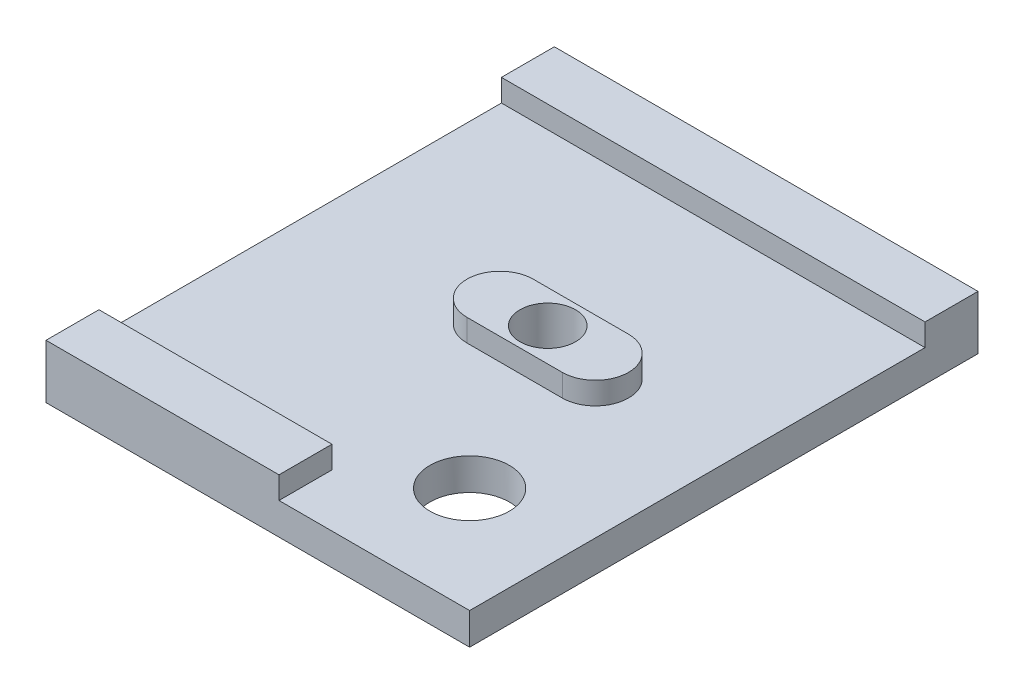
ISO-10303-21;
HEADER;
FILE_DESCRIPTION(('STEP AP214'),'2;1');
FILE_NAME('part.step','',(''),(''),'','','');
FILE_SCHEMA(('AUTOMOTIVE_DESIGN { 1 0 10303 214 1 1 1 1 }'));
ENDSEC;
DATA;
#1=APPLICATION_CONTEXT('core data for automotive mechanical design processes');
#2=APPLICATION_PROTOCOL_DEFINITION('international standard','automotive_design',2000,#1);
#3=PRODUCT_CONTEXT('',#1,'mechanical');
#4=PRODUCT('Part','Part','',(#3));
#5=PRODUCT_RELATED_PRODUCT_CATEGORY('part','',(#4));
#6=PRODUCT_DEFINITION_FORMATION('','',#4);
#7=PRODUCT_DEFINITION_CONTEXT('part definition',#1,'design');
#8=PRODUCT_DEFINITION('design','',#6,#7);
#9=PRODUCT_DEFINITION_SHAPE('','',#8);
#10=(LENGTH_UNIT() NAMED_UNIT(*) SI_UNIT(.MILLI.,.METRE.));
#11=(NAMED_UNIT(*) PLANE_ANGLE_UNIT() SI_UNIT($,.RADIAN.));
#12=(NAMED_UNIT(*) SI_UNIT($,.STERADIAN.) SOLID_ANGLE_UNIT());
#13=UNCERTAINTY_MEASURE_WITH_UNIT(LENGTH_MEASURE(1.E-05),#10,'distance_accuracy_value','');
#14=(GEOMETRIC_REPRESENTATION_CONTEXT(3) GLOBAL_UNCERTAINTY_ASSIGNED_CONTEXT((#13)) GLOBAL_UNIT_ASSIGNED_CONTEXT((#10,
#11,#12)) REPRESENTATION_CONTEXT('',''));
#15=CARTESIAN_POINT('',(0.,0.,0.));
#16=DIRECTION('',(0.,0.,1.));
#17=DIRECTION('',(1.,0.,0.));
#18=AXIS2_PLACEMENT_3D('',#15,#16,#17);
#19=CARTESIAN_POINT('',(0.,3.,0.));
#20=DIRECTION('',(0.,-1.,0.));
#21=DIRECTION('',(0.,0.,-1.));
#22=AXIS2_PLACEMENT_3D('',#19,#20,#21);
#23=PLANE('',#22);
#24=CARTESIAN_POINT('',(10.,3.,14.));
#25=DIRECTION('',(0.,-1.,0.));
#26=DIRECTION('',(0.,0.,-1.));
#27=AXIS2_PLACEMENT_3D('',#24,#25,#26);
#28=CIRCLE('',#27,3.75);
#29=CARTESIAN_POINT('',(10.,3.,10.25));
#30=VERTEX_POINT('',#29);
#31=EDGE_CURVE('E257',#30,#30,#28,.T.);
#32=ORIENTED_EDGE('',*,*,#31,.T.);
#33=EDGE_LOOP('',(#32));
#34=FACE_BOUND('',#33,.T.);
#35=CARTESIAN_POINT('',(-2.,3.,-0.874999999999996));
#36=DIRECTION('',(0.,1.,0.));
#37=DIRECTION('',(0.,0.,1.));
#38=AXIS2_PLACEMENT_3D('',#35,#36,#37);
#39=CIRCLE('',#38,3.125);
#40=CARTESIAN_POINT('',(-2.,3.,-4.));
#41=VERTEX_POINT('',#40);
#42=CARTESIAN_POINT('',(-2.,3.,2.25));
#43=VERTEX_POINT('',#42);
#44=EDGE_CURVE('E64',#41,#43,#39,.T.);
#45=ORIENTED_EDGE('',*,*,#44,.F.);
#46=DIRECTION('',(1.,0.,0.));
#47=VECTOR('',#46,1.);
#48=CARTESIAN_POINT('',(0.,3.,-4.));
#49=LINE('',#48,#47);
#50=CARTESIAN_POINT('',(7.,3.,-4.));
#51=VERTEX_POINT('',#50);
#52=EDGE_CURVE('E162',#41,#51,#49,.T.);
#53=ORIENTED_EDGE('',*,*,#52,.T.);
#54=CARTESIAN_POINT('',(7.,3.,-0.874999999999996));
#55=DIRECTION('',(0.,1.,0.));
#56=DIRECTION('',(0.,0.,1.));
#57=AXIS2_PLACEMENT_3D('',#54,#55,#56);
#58=CIRCLE('',#57,3.125);
#59=CARTESIAN_POINT('',(7.,3.,2.25));
#60=VERTEX_POINT('',#59);
#61=EDGE_CURVE('E172',#60,#51,#58,.T.);
#62=ORIENTED_EDGE('',*,*,#61,.F.);
#63=DIRECTION('',(1.,0.,0.));
#64=VECTOR('',#63,1.);
#65=CARTESIAN_POINT('',(0.,3.,2.25));
#66=LINE('',#65,#64);
#67=EDGE_CURVE('E180',#43,#60,#66,.T.);
#68=ORIENTED_EDGE('',*,*,#67,.F.);
#69=EDGE_LOOP('',(#45,#53,#62,#68));
#70=FACE_BOUND('',#69,.T.);
#71=DIRECTION('',(1.,0.,0.));
#72=VECTOR('',#71,1.);
#73=CARTESIAN_POINT('',(0.,3.,-19.));
#74=LINE('',#73,#72);
#75=CARTESIAN_POINT('',(-20.,3.,-19.));
#76=VERTEX_POINT('',#75);
#77=CARTESIAN_POINT('',(20.,3.,-19.));
#78=VERTEX_POINT('',#77);
#79=EDGE_CURVE('E157',#76,#78,#74,.T.);
#80=ORIENTED_EDGE('',*,*,#79,.F.);
#81=DIRECTION('',(0.,0.,1.));
#82=VECTOR('',#81,1.);
#83=CARTESIAN_POINT('',(-20.,3.,24.));
#84=LINE('',#83,#82);
#85=CARTESIAN_POINT('',(-20.,3.,19.));
#86=VERTEX_POINT('',#85);
#87=EDGE_CURVE('E161',#76,#86,#84,.T.);
#88=ORIENTED_EDGE('',*,*,#87,.T.);
#89=DIRECTION('',(1.,0.,0.));
#90=VECTOR('',#89,1.);
#91=CARTESIAN_POINT('',(0.,3.,19.));
#92=LINE('',#91,#90);
#93=CARTESIAN_POINT('',(2.,3.,19.));
#94=VERTEX_POINT('',#93);
#95=EDGE_CURVE('E200',#86,#94,#92,.T.);
#96=ORIENTED_EDGE('',*,*,#95,.T.);
#97=DIRECTION('',(0.,0.,1.));
#98=VECTOR('',#97,1.);
#99=CARTESIAN_POINT('',(2.,3.,0.));
#100=LINE('',#99,#98);
#101=CARTESIAN_POINT('',(2.,3.,24.));
#102=VERTEX_POINT('',#101);
#103=EDGE_CURVE('E195',#94,#102,#100,.T.);
#104=ORIENTED_EDGE('',*,*,#103,.T.);
#105=DIRECTION('',(1.,0.,0.));
#106=VECTOR('',#105,1.);
#107=CARTESIAN_POINT('',(-20.,3.,24.));
#108=LINE('',#107,#106);
#109=CARTESIAN_POINT('',(20.,3.,24.));
#110=VERTEX_POINT('',#109);
#111=EDGE_CURVE('E223',#102,#110,#108,.T.);
#112=ORIENTED_EDGE('',*,*,#111,.T.);
#113=DIRECTION('',(0.,0.,-1.));
#114=VECTOR('',#113,1.);
#115=CARTESIAN_POINT('',(20.,3.,24.));
#116=LINE('',#115,#114);
#117=EDGE_CURVE('E56',#110,#78,#116,.T.);
#118=ORIENTED_EDGE('',*,*,#117,.T.);
#119=EDGE_LOOP('',(#80,#88,#96,#104,#112,#118));
#120=FACE_BOUND('',#119,.T.);
#121=ADVANCED_FACE('F40',(#34,#70,#120),#23,.F.);
#122=CARTESIAN_POINT('',(20.,3.,24.));
#123=DIRECTION('',(-1.,0.,0.));
#124=DIRECTION('',(0.,0.,1.));
#125=AXIS2_PLACEMENT_3D('',#122,#123,#124);
#126=PLANE('',#125);
#127=DIRECTION('',(0.,0.,-1.));
#128=VECTOR('',#127,1.);
#129=CARTESIAN_POINT('',(20.,0.,24.));
#130=LINE('',#129,#128);
#131=CARTESIAN_POINT('',(20.,0.,24.));
#132=VERTEX_POINT('',#131);
#133=CARTESIAN_POINT('',(20.,0.,-24.));
#134=VERTEX_POINT('',#133);
#135=EDGE_CURVE('E219',#132,#134,#130,.T.);
#136=ORIENTED_EDGE('',*,*,#135,.T.);
#137=DIRECTION('',(0.,-1.,0.));
#138=VECTOR('',#137,1.);
#139=CARTESIAN_POINT('',(20.,3.,-24.));
#140=LINE('',#139,#138);
#141=CARTESIAN_POINT('',(20.,5.1,-24.));
#142=VERTEX_POINT('',#141);
#143=EDGE_CURVE('E11',#142,#134,#140,.T.);
#144=ORIENTED_EDGE('',*,*,#143,.F.);
#145=DIRECTION('',(0.,0.,-1.));
#146=VECTOR('',#145,1.);
#147=CARTESIAN_POINT('',(20.,5.1,0.));
#148=LINE('',#147,#146);
#149=CARTESIAN_POINT('',(20.,5.1,-19.));
#150=VERTEX_POINT('',#149);
#151=EDGE_CURVE('E147',#150,#142,#148,.T.);
#152=ORIENTED_EDGE('',*,*,#151,.F.);
#153=DIRECTION('',(0.,-1.,0.));
#154=VECTOR('',#153,1.);
#155=CARTESIAN_POINT('',(20.,5.1,-19.));
#156=LINE('',#155,#154);
#157=EDGE_CURVE('E143',#150,#78,#156,.T.);
#158=ORIENTED_EDGE('',*,*,#157,.T.);
#159=ORIENTED_EDGE('',*,*,#117,.F.);
#160=DIRECTION('',(0.,-1.,0.));
#161=VECTOR('',#160,1.);
#162=CARTESIAN_POINT('',(20.,3.,24.));
#163=LINE('',#162,#161);
#164=EDGE_CURVE('E225',#110,#132,#163,.T.);
#165=ORIENTED_EDGE('',*,*,#164,.T.);
#166=EDGE_LOOP('',(#136,#144,#152,#158,#159,#165));
#167=FACE_BOUND('',#166,.T.);
#168=ADVANCED_FACE('F42',(#167),#126,.F.);
#169=CARTESIAN_POINT('',(-20.,3.,-24.));
#170=DIRECTION('',(0.,0.,1.));
#171=DIRECTION('',(1.,0.,0.));
#172=AXIS2_PLACEMENT_3D('',#169,#170,#171);
#173=PLANE('',#172);
#174=DIRECTION('',(-1.,0.,0.));
#175=VECTOR('',#174,1.);
#176=CARTESIAN_POINT('',(-20.,0.,-24.));
#177=LINE('',#176,#175);
#178=CARTESIAN_POINT('',(-20.,0.,-24.));
#179=VERTEX_POINT('',#178);
#180=EDGE_CURVE('E228',#134,#179,#177,.T.);
#181=ORIENTED_EDGE('',*,*,#180,.T.);
#182=DIRECTION('',(0.,-1.,0.));
#183=VECTOR('',#182,1.);
#184=CARTESIAN_POINT('',(-20.,3.,-24.));
#185=LINE('',#184,#183);
#186=CARTESIAN_POINT('',(-20.,5.1,-24.));
#187=VERTEX_POINT('',#186);
#188=EDGE_CURVE('E49',#187,#179,#185,.T.);
#189=ORIENTED_EDGE('',*,*,#188,.F.);
#190=DIRECTION('',(-1.,0.,0.));
#191=VECTOR('',#190,1.);
#192=CARTESIAN_POINT('',(0.,5.1,-24.));
#193=LINE('',#192,#191);
#194=EDGE_CURVE('E154',#142,#187,#193,.T.);
#195=ORIENTED_EDGE('',*,*,#194,.F.);
#196=ORIENTED_EDGE('',*,*,#143,.T.);
#197=EDGE_LOOP('',(#181,#189,#195,#196));
#198=FACE_BOUND('',#197,.T.);
#199=ADVANCED_FACE('F309',(#198),#173,.F.);
#200=CARTESIAN_POINT('',(-20.,3.,24.));
#201=DIRECTION('',(1.,0.,0.));
#202=DIRECTION('',(0.,0.,-1.));
#203=AXIS2_PLACEMENT_3D('',#200,#201,#202);
#204=PLANE('',#203);
#205=DIRECTION('',(0.,0.,1.));
#206=VECTOR('',#205,1.);
#207=CARTESIAN_POINT('',(-20.,0.,24.));
#208=LINE('',#207,#206);
#209=CARTESIAN_POINT('',(-20.,0.,24.));
#210=VERTEX_POINT('',#209);
#211=EDGE_CURVE('E230',#179,#210,#208,.T.);
#212=ORIENTED_EDGE('',*,*,#211,.T.);
#213=DIRECTION('',(0.,-1.,0.));
#214=VECTOR('',#213,1.);
#215=CARTESIAN_POINT('',(-20.,3.,24.));
#216=LINE('',#215,#214);
#217=CARTESIAN_POINT('',(-20.,5.1,24.));
#218=VERTEX_POINT('',#217);
#219=EDGE_CURVE('E235',#218,#210,#216,.T.);
#220=ORIENTED_EDGE('',*,*,#219,.F.);
#221=DIRECTION('',(0.,0.,1.));
#222=VECTOR('',#221,1.);
#223=CARTESIAN_POINT('',(-20.,5.1,0.));
#224=LINE('',#223,#222);
#225=CARTESIAN_POINT('',(-20.,5.1,19.));
#226=VERTEX_POINT('',#225);
#227=EDGE_CURVE('E203',#226,#218,#224,.T.);
#228=ORIENTED_EDGE('',*,*,#227,.F.);
#229=DIRECTION('',(0.,-1.,0.));
#230=VECTOR('',#229,1.);
#231=CARTESIAN_POINT('',(-20.,5.1,19.));
#232=LINE('',#231,#230);
#233=EDGE_CURVE('E214',#226,#86,#232,.T.);
#234=ORIENTED_EDGE('',*,*,#233,.T.);
#235=ORIENTED_EDGE('',*,*,#87,.F.);
#236=DIRECTION('',(0.,-1.,0.));
#237=VECTOR('',#236,1.);
#238=CARTESIAN_POINT('',(-20.,5.1,-19.));
#239=LINE('',#238,#237);
#240=CARTESIAN_POINT('',(-20.,5.1,-19.));
#241=VERTEX_POINT('',#240);
#242=EDGE_CURVE('E141',#241,#76,#239,.T.);
#243=ORIENTED_EDGE('',*,*,#242,.F.);
#244=DIRECTION('',(0.,0.,1.));
#245=VECTOR('',#244,1.);
#246=CARTESIAN_POINT('',(-20.,5.1,0.));
#247=LINE('',#246,#245);
#248=EDGE_CURVE('E148',#187,#241,#247,.T.);
#249=ORIENTED_EDGE('',*,*,#248,.F.);
#250=ORIENTED_EDGE('',*,*,#188,.T.);
#251=EDGE_LOOP('',(#212,#220,#228,#234,#235,#243,#249,#250));
#252=FACE_BOUND('',#251,.T.);
#253=ADVANCED_FACE('F159',(#252),#204,.F.);
#254=CARTESIAN_POINT('',(-20.,3.,24.));
#255=DIRECTION('',(0.,0.,-1.));
#256=DIRECTION('',(-1.,0.,0.));
#257=AXIS2_PLACEMENT_3D('',#254,#255,#256);
#258=PLANE('',#257);
#259=DIRECTION('',(1.,0.,0.));
#260=VECTOR('',#259,1.);
#261=CARTESIAN_POINT('',(-20.,0.,24.));
#262=LINE('',#261,#260);
#263=EDGE_CURVE('E221',#210,#132,#262,.T.);
#264=ORIENTED_EDGE('',*,*,#263,.T.);
#265=ORIENTED_EDGE('',*,*,#164,.F.);
#266=ORIENTED_EDGE('',*,*,#111,.F.);
#267=DIRECTION('',(0.,-1.,0.));
#268=VECTOR('',#267,1.);
#269=CARTESIAN_POINT('',(2.,5.1,24.));
#270=LINE('',#269,#268);
#271=CARTESIAN_POINT('',(2.,5.1,24.));
#272=VERTEX_POINT('',#271);
#273=EDGE_CURVE('E208',#272,#102,#270,.T.);
#274=ORIENTED_EDGE('',*,*,#273,.F.);
#275=DIRECTION('',(1.,0.,0.));
#276=VECTOR('',#275,1.);
#277=CARTESIAN_POINT('',(0.,5.1,24.));
#278=LINE('',#277,#276);
#279=EDGE_CURVE('E206',#218,#272,#278,.T.);
#280=ORIENTED_EDGE('',*,*,#279,.F.);
#281=ORIENTED_EDGE('',*,*,#219,.T.);
#282=EDGE_LOOP('',(#264,#265,#266,#274,#280,#281));
#283=FACE_BOUND('',#282,.T.);
#284=ADVANCED_FACE('F246',(#283),#258,.F.);
#285=CARTESIAN_POINT('',(0.,0.,0.));
#286=DIRECTION('',(0.,-1.,0.));
#287=DIRECTION('',(0.,0.,-1.));
#288=AXIS2_PLACEMENT_3D('',#285,#286,#287);
#289=PLANE('',#288);
#290=CARTESIAN_POINT('',(10.,0.,14.));
#291=DIRECTION('',(0.,1.,0.));
#292=DIRECTION('',(0.,0.,1.));
#293=AXIS2_PLACEMENT_3D('',#290,#291,#292);
#294=CIRCLE('',#293,3.75);
#295=CARTESIAN_POINT('',(10.,0.,17.75));
#296=VERTEX_POINT('',#295);
#297=EDGE_CURVE('E262',#296,#296,#294,.T.);
#298=ORIENTED_EDGE('',*,*,#297,.T.);
#299=EDGE_LOOP('',(#298));
#300=FACE_BOUND('',#299,.T.);
#301=CARTESIAN_POINT('',(2.49999999999887,0.,-0.875000000003864));
#302=DIRECTION('',(0.,1.,0.));
#303=DIRECTION('',(0.,0.,1.));
#304=AXIS2_PLACEMENT_3D('',#301,#302,#303);
#305=CIRCLE('',#304,2.625);
#306=CARTESIAN_POINT('',(2.49999999999887,0.,1.74999999999614));
#307=VERTEX_POINT('',#306);
#308=EDGE_CURVE('E253',#307,#307,#305,.T.);
#309=ORIENTED_EDGE('',*,*,#308,.T.);
#310=EDGE_LOOP('',(#309));
#311=FACE_BOUND('',#310,.T.);
#312=ORIENTED_EDGE('',*,*,#135,.F.);
#313=ORIENTED_EDGE('',*,*,#263,.F.);
#314=ORIENTED_EDGE('',*,*,#211,.F.);
#315=ORIENTED_EDGE('',*,*,#180,.F.);
#316=EDGE_LOOP('',(#312,#313,#314,#315));
#317=FACE_BOUND('',#316,.T.);
#318=ADVANCED_FACE('F243',(#300,#311,#317),#289,.T.);
#319=CARTESIAN_POINT('',(2.,5.1,0.));
#320=DIRECTION('',(1.,0.,0.));
#321=DIRECTION('',(0.,0.,-1.));
#322=AXIS2_PLACEMENT_3D('',#319,#320,#321);
#323=PLANE('',#322);
#324=ORIENTED_EDGE('',*,*,#103,.F.);
#325=DIRECTION('',(0.,-1.,0.));
#326=VECTOR('',#325,1.);
#327=CARTESIAN_POINT('',(2.,5.1,19.));
#328=LINE('',#327,#326);
#329=CARTESIAN_POINT('',(2.,5.1,19.));
#330=VERTEX_POINT('',#329);
#331=EDGE_CURVE('E216',#330,#94,#328,.T.);
#332=ORIENTED_EDGE('',*,*,#331,.F.);
#333=DIRECTION('',(0.,0.,1.));
#334=VECTOR('',#333,1.);
#335=CARTESIAN_POINT('',(2.,5.1,0.));
#336=LINE('',#335,#334);
#337=EDGE_CURVE('E196',#330,#272,#336,.T.);
#338=ORIENTED_EDGE('',*,*,#337,.T.);
#339=ORIENTED_EDGE('',*,*,#273,.T.);
#340=EDGE_LOOP('',(#324,#332,#338,#339));
#341=FACE_BOUND('',#340,.T.);
#342=ADVANCED_FACE('F285',(#341),#323,.T.);
#343=CARTESIAN_POINT('',(0.,5.1,19.));
#344=DIRECTION('',(0.,0.,-1.));
#345=DIRECTION('',(-1.,0.,0.));
#346=AXIS2_PLACEMENT_3D('',#343,#344,#345);
#347=PLANE('',#346);
#348=ORIENTED_EDGE('',*,*,#95,.F.);
#349=ORIENTED_EDGE('',*,*,#233,.F.);
#350=DIRECTION('',(1.,0.,0.));
#351=VECTOR('',#350,1.);
#352=CARTESIAN_POINT('',(0.,5.1,19.));
#353=LINE('',#352,#351);
#354=EDGE_CURVE('E199',#226,#330,#353,.T.);
#355=ORIENTED_EDGE('',*,*,#354,.T.);
#356=ORIENTED_EDGE('',*,*,#331,.T.);
#357=EDGE_LOOP('',(#348,#349,#355,#356));
#358=FACE_BOUND('',#357,.T.);
#359=ADVANCED_FACE('F282',(#358),#347,.T.);
#360=CARTESIAN_POINT('',(0.,5.1,0.));
#361=DIRECTION('',(0.,1.,0.));
#362=DIRECTION('',(0.,0.,1.));
#363=AXIS2_PLACEMENT_3D('',#360,#361,#362);
#364=PLANE('',#363);
#365=ORIENTED_EDGE('',*,*,#337,.F.);
#366=ORIENTED_EDGE('',*,*,#354,.F.);
#367=ORIENTED_EDGE('',*,*,#227,.T.);
#368=ORIENTED_EDGE('',*,*,#279,.T.);
#369=EDGE_LOOP('',(#365,#366,#367,#368));
#370=FACE_BOUND('',#369,.T.);
#371=ADVANCED_FACE('F287',(#370),#364,.T.);
#372=CARTESIAN_POINT('',(0.,5.1,-4.));
#373=DIRECTION('',(0.,0.,-1.));
#374=DIRECTION('',(-1.,0.,0.));
#375=AXIS2_PLACEMENT_3D('',#372,#373,#374);
#376=PLANE('',#375);
#377=ORIENTED_EDGE('',*,*,#52,.F.);
#378=DIRECTION('',(0.,-1.,0.));
#379=VECTOR('',#378,1.);
#380=CARTESIAN_POINT('',(-2.,5.1,-4.));
#381=LINE('',#380,#379);
#382=CARTESIAN_POINT('',(-2.,5.1,-4.));
#383=VERTEX_POINT('',#382);
#384=EDGE_CURVE('E193',#383,#41,#381,.T.);
#385=ORIENTED_EDGE('',*,*,#384,.F.);
#386=DIRECTION('',(1.,0.,0.));
#387=VECTOR('',#386,1.);
#388=CARTESIAN_POINT('',(0.,5.1,-4.));
#389=LINE('',#388,#387);
#390=CARTESIAN_POINT('',(7.,5.1,-4.));
#391=VERTEX_POINT('',#390);
#392=EDGE_CURVE('E168',#383,#391,#389,.T.);
#393=ORIENTED_EDGE('',*,*,#392,.T.);
#394=DIRECTION('',(0.,-1.,0.));
#395=VECTOR('',#394,1.);
#396=CARTESIAN_POINT('',(7.,5.1,-4.));
#397=LINE('',#396,#395);
#398=EDGE_CURVE('E177',#391,#51,#397,.T.);
#399=ORIENTED_EDGE('',*,*,#398,.T.);
#400=EDGE_LOOP('',(#377,#385,#393,#399));
#401=FACE_BOUND('',#400,.T.);
#402=ADVANCED_FACE('F290',(#401),#376,.T.);
#403=CARTESIAN_POINT('',(-2.,5.1,-0.874999999999996));
#404=DIRECTION('',(0.,-1.,0.));
#405=DIRECTION('',(0.,0.,-1.));
#406=AXIS2_PLACEMENT_3D('',#403,#404,#405);
#407=CYLINDRICAL_SURFACE('',#406,3.125);
#408=ORIENTED_EDGE('',*,*,#44,.T.);
#409=DIRECTION('',(0.,-1.,0.));
#410=VECTOR('',#409,1.);
#411=CARTESIAN_POINT('',(-2.,5.1,2.25));
#412=LINE('',#411,#410);
#413=CARTESIAN_POINT('',(-2.,5.1,2.25));
#414=VERTEX_POINT('',#413);
#415=EDGE_CURVE('E190',#414,#43,#412,.T.);
#416=ORIENTED_EDGE('',*,*,#415,.F.);
#417=CARTESIAN_POINT('',(-2.,5.1,-0.874999999999996));
#418=DIRECTION('',(0.,1.,0.));
#419=DIRECTION('',(0.,0.,1.));
#420=AXIS2_PLACEMENT_3D('',#417,#418,#419);
#421=CIRCLE('',#420,3.125);
#422=EDGE_CURVE('E171',#383,#414,#421,.T.);
#423=ORIENTED_EDGE('',*,*,#422,.F.);
#424=ORIENTED_EDGE('',*,*,#384,.T.);
#425=EDGE_LOOP('',(#408,#416,#423,#424));
#426=FACE_BOUND('',#425,.T.);
#427=ADVANCED_FACE('F296',(#426),#407,.T.);
#428=CARTESIAN_POINT('',(0.,5.1,2.25));
#429=DIRECTION('',(0.,0.,-1.));
#430=DIRECTION('',(-1.,0.,0.));
#431=AXIS2_PLACEMENT_3D('',#428,#429,#430);
#432=PLANE('',#431);
#433=ORIENTED_EDGE('',*,*,#67,.T.);
#434=DIRECTION('',(0.,-1.,0.));
#435=VECTOR('',#434,1.);
#436=CARTESIAN_POINT('',(7.,5.1,2.25));
#437=LINE('',#436,#435);
#438=CARTESIAN_POINT('',(7.,5.1,2.25));
#439=VERTEX_POINT('',#438);
#440=EDGE_CURVE('E187',#439,#60,#437,.T.);
#441=ORIENTED_EDGE('',*,*,#440,.F.);
#442=DIRECTION('',(1.,0.,0.));
#443=VECTOR('',#442,1.);
#444=CARTESIAN_POINT('',(0.,5.1,2.25));
#445=LINE('',#444,#443);
#446=EDGE_CURVE('E174',#414,#439,#445,.T.);
#447=ORIENTED_EDGE('',*,*,#446,.F.);
#448=ORIENTED_EDGE('',*,*,#415,.T.);
#449=EDGE_LOOP('',(#433,#441,#447,#448));
#450=FACE_BOUND('',#449,.T.);
#451=ADVANCED_FACE('F366',(#450),#432,.F.);
#452=CARTESIAN_POINT('',(7.,5.1,-0.874999999999996));
#453=DIRECTION('',(0.,-1.,0.));
#454=DIRECTION('',(0.,0.,-1.));
#455=AXIS2_PLACEMENT_3D('',#452,#453,#454);
#456=CYLINDRICAL_SURFACE('',#455,3.125);
#457=ORIENTED_EDGE('',*,*,#61,.T.);
#458=ORIENTED_EDGE('',*,*,#398,.F.);
#459=CARTESIAN_POINT('',(7.,5.1,-0.874999999999996));
#460=DIRECTION('',(0.,1.,0.));
#461=DIRECTION('',(0.,0.,1.));
#462=AXIS2_PLACEMENT_3D('',#459,#460,#461);
#463=CIRCLE('',#462,3.125);
#464=EDGE_CURVE('E176',#439,#391,#463,.T.);
#465=ORIENTED_EDGE('',*,*,#464,.F.);
#466=ORIENTED_EDGE('',*,*,#440,.T.);
#467=EDGE_LOOP('',(#457,#458,#465,#466));
#468=FACE_BOUND('',#467,.T.);
#469=ADVANCED_FACE('F359',(#468),#456,.T.);
#470=CARTESIAN_POINT('',(0.,5.1,0.));
#471=DIRECTION('',(0.,1.,0.));
#472=DIRECTION('',(0.,0.,1.));
#473=AXIS2_PLACEMENT_3D('',#470,#471,#472);
#474=PLANE('',#473);
#475=CARTESIAN_POINT('',(2.49999999999887,5.1,-0.875000000003864));
#476=DIRECTION('',(0.,1.,0.));
#477=DIRECTION('',(0.,0.,1.));
#478=AXIS2_PLACEMENT_3D('',#475,#476,#477);
#479=CIRCLE('',#478,2.625);
#480=CARTESIAN_POINT('',(2.49999999999887,5.1,1.74999999999614));
#481=VERTEX_POINT('',#480);
#482=EDGE_CURVE('E44',#481,#481,#479,.T.);
#483=ORIENTED_EDGE('',*,*,#482,.F.);
#484=EDGE_LOOP('',(#483));
#485=FACE_BOUND('',#484,.T.);
#486=ORIENTED_EDGE('',*,*,#392,.F.);
#487=ORIENTED_EDGE('',*,*,#422,.T.);
#488=ORIENTED_EDGE('',*,*,#446,.T.);
#489=ORIENTED_EDGE('',*,*,#464,.T.);
#490=EDGE_LOOP('',(#486,#487,#488,#489));
#491=FACE_BOUND('',#490,.T.);
#492=ADVANCED_FACE('F352',(#485,#491),#474,.T.);
#493=CARTESIAN_POINT('',(0.,5.1,-19.));
#494=DIRECTION('',(0.,0.,-1.));
#495=DIRECTION('',(-1.,0.,0.));
#496=AXIS2_PLACEMENT_3D('',#493,#494,#495);
#497=PLANE('',#496);
#498=ORIENTED_EDGE('',*,*,#79,.T.);
#499=ORIENTED_EDGE('',*,*,#157,.F.);
#500=DIRECTION('',(1.,0.,0.));
#501=VECTOR('',#500,1.);
#502=CARTESIAN_POINT('',(0.,5.1,-19.));
#503=LINE('',#502,#501);
#504=EDGE_CURVE('E137',#241,#150,#503,.T.);
#505=ORIENTED_EDGE('',*,*,#504,.F.);
#506=ORIENTED_EDGE('',*,*,#242,.T.);
#507=EDGE_LOOP('',(#498,#499,#505,#506));
#508=FACE_BOUND('',#507,.T.);
#509=ADVANCED_FACE('F139',(#508),#497,.F.);
#510=CARTESIAN_POINT('',(0.,5.1,0.));
#511=DIRECTION('',(0.,1.,0.));
#512=DIRECTION('',(0.,0.,1.));
#513=AXIS2_PLACEMENT_3D('',#510,#511,#512);
#514=PLANE('',#513);
#515=ORIENTED_EDGE('',*,*,#248,.T.);
#516=ORIENTED_EDGE('',*,*,#504,.T.);
#517=ORIENTED_EDGE('',*,*,#151,.T.);
#518=ORIENTED_EDGE('',*,*,#194,.T.);
#519=EDGE_LOOP('',(#515,#516,#517,#518));
#520=FACE_BOUND('',#519,.T.);
#521=ADVANCED_FACE('F152',(#520),#514,.T.);
#522=CARTESIAN_POINT('',(2.49999999999887,0.,-0.875000000003864));
#523=DIRECTION('',(0.,1.,0.));
#524=DIRECTION('',(0.,0.,1.));
#525=AXIS2_PLACEMENT_3D('',#522,#523,#524);
#526=CYLINDRICAL_SURFACE('',#525,2.625);
#527=ORIENTED_EDGE('',*,*,#482,.T.);
#528=EDGE_LOOP('',(#527));
#529=FACE_BOUND('',#528,.T.);
#530=ORIENTED_EDGE('',*,*,#308,.F.);
#531=EDGE_LOOP('',(#530));
#532=FACE_BOUND('',#531,.T.);
#533=ADVANCED_FACE('F272',(#529,#532),#526,.F.);
#534=CARTESIAN_POINT('',(10.,0.,14.));
#535=DIRECTION('',(0.,1.,0.));
#536=DIRECTION('',(0.,0.,1.));
#537=AXIS2_PLACEMENT_3D('',#534,#535,#536);
#538=CYLINDRICAL_SURFACE('',#537,3.75);
#539=ORIENTED_EDGE('',*,*,#297,.F.);
#540=EDGE_LOOP('',(#539));
#541=FACE_BOUND('',#540,.T.);
#542=ORIENTED_EDGE('',*,*,#31,.F.);
#543=EDGE_LOOP('',(#542));
#544=FACE_BOUND('',#543,.T.);
#545=ADVANCED_FACE('F269',(#541,#544),#538,.F.);
#546=CLOSED_SHELL('',(#121,#168,#199,#253,#284,#318,#342,#359,#371,#402,#427,#451,#469,#492,
#509,#521,#533,#545));
#547=MANIFOLD_SOLID_BREP('B2',#546);
#548=ADVANCED_BREP_SHAPE_REPRESENTATION('',(#18,#547),#14);
#549=SHAPE_DEFINITION_REPRESENTATION(#9,#548);
ENDSEC;
END-ISO-10303-21;
